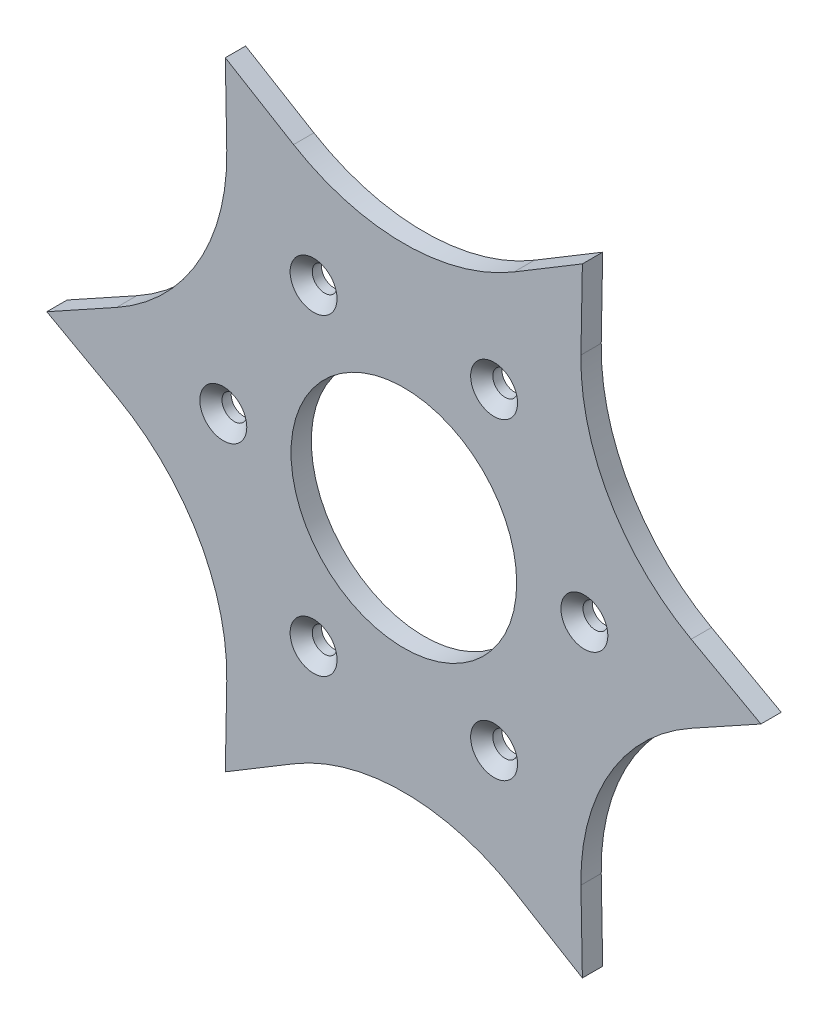
ISO-10303-21;
HEADER;
FILE_DESCRIPTION(('STEP AP214'),'2;1');
FILE_NAME('part.step','',(''),(''),'','','');
FILE_SCHEMA(('AUTOMOTIVE_DESIGN { 1 0 10303 214 1 1 1 1 }'));
ENDSEC;
DATA;
#1=APPLICATION_CONTEXT('core data for automotive mechanical design processes');
#2=APPLICATION_PROTOCOL_DEFINITION('international standard','automotive_design',2000,#1);
#3=PRODUCT_CONTEXT('',#1,'mechanical');
#4=PRODUCT('Part','Part','',(#3));
#5=PRODUCT_RELATED_PRODUCT_CATEGORY('part','',(#4));
#6=PRODUCT_DEFINITION_FORMATION('','',#4);
#7=PRODUCT_DEFINITION_CONTEXT('part definition',#1,'design');
#8=PRODUCT_DEFINITION('design','',#6,#7);
#9=PRODUCT_DEFINITION_SHAPE('','',#8);
#10=(LENGTH_UNIT() NAMED_UNIT(*) SI_UNIT(.MILLI.,.METRE.));
#11=(NAMED_UNIT(*) PLANE_ANGLE_UNIT() SI_UNIT($,.RADIAN.));
#12=(NAMED_UNIT(*) SI_UNIT($,.STERADIAN.) SOLID_ANGLE_UNIT());
#13=UNCERTAINTY_MEASURE_WITH_UNIT(LENGTH_MEASURE(1.E-05),#10,'distance_accuracy_value','');
#14=(GEOMETRIC_REPRESENTATION_CONTEXT(3) GLOBAL_UNCERTAINTY_ASSIGNED_CONTEXT((#13)) GLOBAL_UNIT_ASSIGNED_CONTEXT((#10,
#11,#12)) REPRESENTATION_CONTEXT('',''));
#15=CARTESIAN_POINT('',(0.,0.,0.));
#16=DIRECTION('',(0.,0.,1.));
#17=DIRECTION('',(1.,0.,0.));
#18=AXIS2_PLACEMENT_3D('',#15,#16,#17);
#19=CARTESIAN_POINT('',(86.6025403784862,-49.9999999999703,67.0456126137309));
#20=DIRECTION('',(0.,0.,-1.));
#21=DIRECTION('',(-1.,0.,0.));
#22=AXIS2_PLACEMENT_3D('',#19,#20,#21);
#23=CYLINDRICAL_SURFACE('',#22,47.375);
#24=CARTESIAN_POINT('',(86.6025403784862,-49.9999999999703,62.5456126137309));
#25=DIRECTION('',(0.,0.,1.));
#26=DIRECTION('',(1.,0.,0.));
#27=AXIS2_PLACEMENT_3D('',#24,#25,#26);
#28=CIRCLE('',#27,47.375);
#29=CARTESIAN_POINT('',(63.667217125157,-8.54687499997423,62.5456126137309));
#30=VERTEX_POINT('',#29);
#31=CARTESIAN_POINT('',(39.2354194355732,-50.8639899185789,62.5456126137309));
#32=VERTEX_POINT('',#31);
#33=EDGE_CURVE('E192',#30,#32,#28,.T.);
#34=ORIENTED_EDGE('',*,*,#33,.F.);
#35=DIRECTION('',(0.,0.,-1.));
#36=VECTOR('',#35,1.);
#37=CARTESIAN_POINT('',(63.667217125157,-8.54687499997423,67.0456126137309));
#38=LINE('',#37,#36);
#39=CARTESIAN_POINT('',(63.667217125157,-8.54687499997423,67.0456126137309));
#40=VERTEX_POINT('',#39);
#41=EDGE_CURVE('E11',#40,#30,#38,.T.);
#42=ORIENTED_EDGE('',*,*,#41,.F.);
#43=CARTESIAN_POINT('',(86.6025403784862,-49.9999999999703,67.0456126137309));
#44=DIRECTION('',(0.,0.,1.));
#45=DIRECTION('',(1.,0.,0.));
#46=AXIS2_PLACEMENT_3D('',#43,#44,#45);
#47=CIRCLE('',#46,47.375);
#48=CARTESIAN_POINT('',(39.2354194355732,-50.8639899185789,67.0456126137309));
#49=VERTEX_POINT('',#48);
#50=EDGE_CURVE('E246',#40,#49,#47,.T.);
#51=ORIENTED_EDGE('',*,*,#50,.T.);
#52=DIRECTION('',(0.,0.,-1.));
#53=VECTOR('',#52,1.);
#54=CARTESIAN_POINT('',(39.2354194355732,-50.8639899185789,67.0456126137309));
#55=LINE('',#54,#53);
#56=EDGE_CURVE('E115',#49,#32,#55,.T.);
#57=ORIENTED_EDGE('',*,*,#56,.T.);
#58=EDGE_LOOP('',(#34,#42,#51,#57));
#59=FACE_BOUND('',#58,.T.);
#60=ADVANCED_FACE('F35',(#59),#23,.F.);
#61=CARTESIAN_POINT('',(18.542524822455,-33.5136152558557,67.0456126137309));
#62=DIRECTION('',(0.484122918276079,-0.874999999999916,0.));
#63=DIRECTION('',(0.874999999999916,0.484122918276079,0.));
#64=AXIS2_PLACEMENT_3D('',#61,#62,#63);
#65=PLANE('',#64);
#66=DIRECTION('',(-0.874999999999916,-0.484122918276079,0.));
#67=VECTOR('',#66,1.);
#68=CARTESIAN_POINT('',(18.542524822455,-33.5136152558557,62.5456126137309));
#69=LINE('',#68,#67);
#70=CARTESIAN_POINT('',(79.1147725758089,2.79082312815149E-11,62.5456126137309));
#71=VERTEX_POINT('',#70);
#72=EDGE_CURVE('E195',#71,#30,#69,.T.);
#73=ORIENTED_EDGE('',*,*,#72,.F.);
#74=DIRECTION('',(0.,0.,-1.));
#75=VECTOR('',#74,1.);
#76=CARTESIAN_POINT('',(79.1147725758089,2.79082312815149E-11,67.0456126137309));
#77=LINE('',#76,#75);
#78=CARTESIAN_POINT('',(79.1147725758089,2.79082312815149E-11,67.0456126137309));
#79=VERTEX_POINT('',#78);
#80=EDGE_CURVE('E43',#79,#71,#77,.T.);
#81=ORIENTED_EDGE('',*,*,#80,.F.);
#82=DIRECTION('',(-0.874999999999916,-0.484122918276079,0.));
#83=VECTOR('',#82,1.);
#84=CARTESIAN_POINT('',(18.542524822455,-33.5136152558557,67.0456126137309));
#85=LINE('',#84,#83);
#86=EDGE_CURVE('E288',#79,#40,#85,.T.);
#87=ORIENTED_EDGE('',*,*,#86,.T.);
#88=ORIENTED_EDGE('',*,*,#41,.T.);
#89=EDGE_LOOP('',(#73,#81,#87,#88));
#90=FACE_BOUND('',#89,.T.);
#91=ADVANCED_FACE('F287',(#90),#65,.T.);
#92=CARTESIAN_POINT('',(18.5425248224775,33.5136152558977,67.0456126137309));
#93=DIRECTION('',(-0.484122918276064,-0.874999999999924,0.));
#94=DIRECTION('',(0.874999999999924,-0.484122918276064,0.));
#95=AXIS2_PLACEMENT_3D('',#92,#93,#94);
#96=PLANE('',#95);
#97=DIRECTION('',(-0.874999999999924,0.484122918276064,0.));
#98=VECTOR('',#97,1.);
#99=CARTESIAN_POINT('',(18.5425248224775,33.5136152558977,62.5456126137309));
#100=LINE('',#99,#98);
#101=CARTESIAN_POINT('',(63.6672171251116,8.54687500005483,62.5456126137309));
#102=VERTEX_POINT('',#101);
#103=EDGE_CURVE('E199',#71,#102,#100,.T.);
#104=ORIENTED_EDGE('',*,*,#103,.T.);
#105=DIRECTION('',(0.,0.,-1.));
#106=VECTOR('',#105,1.);
#107=CARTESIAN_POINT('',(63.6672171251116,8.54687500005483,67.0456126137309));
#108=LINE('',#107,#106);
#109=CARTESIAN_POINT('',(63.6672171251116,8.54687500005483,67.0456126137309));
#110=VERTEX_POINT('',#109);
#111=EDGE_CURVE('E272',#110,#102,#108,.T.);
#112=ORIENTED_EDGE('',*,*,#111,.F.);
#113=DIRECTION('',(-0.874999999999924,0.484122918276064,0.));
#114=VECTOR('',#113,1.);
#115=CARTESIAN_POINT('',(18.5425248224775,33.5136152558977,67.0456126137309));
#116=LINE('',#115,#114);
#117=EDGE_CURVE('E278',#79,#110,#116,.T.);
#118=ORIENTED_EDGE('',*,*,#117,.F.);
#119=ORIENTED_EDGE('',*,*,#80,.T.);
#120=EDGE_LOOP('',(#104,#112,#118,#119));
#121=FACE_BOUND('',#120,.T.);
#122=ADVANCED_FACE('F276',(#121),#96,.F.);
#123=CARTESIAN_POINT('',(86.6025403784392,50.0000000000517,67.0456126137309));
#124=DIRECTION('',(0.,0.,-1.));
#125=DIRECTION('',(-1.,0.,0.));
#126=AXIS2_PLACEMENT_3D('',#123,#124,#125);
#127=CYLINDRICAL_SURFACE('',#126,47.375);
#128=CARTESIAN_POINT('',(86.6025403784392,50.0000000000517,62.5456126137309));
#129=DIRECTION('',(0.,0.,1.));
#130=DIRECTION('',(1.,0.,0.));
#131=AXIS2_PLACEMENT_3D('',#128,#129,#130);
#132=CIRCLE('',#131,47.375);
#133=CARTESIAN_POINT('',(39.2354194355262,50.8639899186586,62.5456126137309));
#134=VERTEX_POINT('',#133);
#135=EDGE_CURVE('E202',#134,#102,#132,.T.);
#136=ORIENTED_EDGE('',*,*,#135,.F.);
#137=DIRECTION('',(0.,0.,-1.));
#138=VECTOR('',#137,1.);
#139=CARTESIAN_POINT('',(39.2354194355262,50.8639899186586,67.0456126137309));
#140=LINE('',#139,#138);
#141=CARTESIAN_POINT('',(39.2354194355262,50.8639899186586,67.0456126137309));
#142=VERTEX_POINT('',#141);
#143=EDGE_CURVE('E270',#142,#134,#140,.T.);
#144=ORIENTED_EDGE('',*,*,#143,.F.);
#145=CARTESIAN_POINT('',(86.6025403784392,50.0000000000517,67.0456126137309));
#146=DIRECTION('',(0.,0.,1.));
#147=DIRECTION('',(1.,0.,0.));
#148=AXIS2_PLACEMENT_3D('',#145,#146,#147);
#149=CIRCLE('',#148,47.375);
#150=EDGE_CURVE('E296',#142,#110,#149,.T.);
#151=ORIENTED_EDGE('',*,*,#150,.T.);
#152=ORIENTED_EDGE('',*,*,#111,.T.);
#153=EDGE_LOOP('',(#136,#144,#151,#152));
#154=FACE_BOUND('',#153,.T.);
#155=ADVANCED_FACE('F354',(#154),#127,.F.);
#156=CARTESIAN_POINT('',(38.2949045954563,-0.698510081378177,67.0456126137309));
#157=DIRECTION('',(0.999833687449351,-0.0182372542186135,0.));
#158=DIRECTION('',(0.0182372542186135,0.999833687449351,0.));
#159=AXIS2_PLACEMENT_3D('',#156,#157,#158);
#160=PLANE('',#159);
#161=DIRECTION('',(-0.0182372542186135,-0.999833687449351,0.));
#162=VECTOR('',#161,1.);
#163=CARTESIAN_POINT('',(38.2949045954563,-0.698510081378177,62.5456126137309));
#164=LINE('',#163,#162);
#165=CARTESIAN_POINT('',(39.5573862878801,68.515402865293,62.5456126137309));
#166=VERTEX_POINT('',#165);
#167=EDGE_CURVE('E205',#166,#134,#164,.T.);
#168=ORIENTED_EDGE('',*,*,#167,.F.);
#169=DIRECTION('',(0.,0.,-1.));
#170=VECTOR('',#169,1.);
#171=CARTESIAN_POINT('',(39.5573862878801,68.515402865293,67.0456126137309));
#172=LINE('',#171,#170);
#173=CARTESIAN_POINT('',(39.5573862878801,68.515402865293,67.0456126137309));
#174=VERTEX_POINT('',#173);
#175=EDGE_CURVE('E268',#174,#166,#172,.T.);
#176=ORIENTED_EDGE('',*,*,#175,.F.);
#177=DIRECTION('',(-0.0182372542186135,-0.999833687449351,0.));
#178=VECTOR('',#177,1.);
#179=CARTESIAN_POINT('',(38.2949045954563,-0.698510081378177,67.0456126137309));
#180=LINE('',#179,#178);
#181=EDGE_CURVE('E299',#174,#142,#180,.T.);
#182=ORIENTED_EDGE('',*,*,#181,.T.);
#183=ORIENTED_EDGE('',*,*,#143,.T.);
#184=EDGE_LOOP('',(#168,#176,#182,#183));
#185=FACE_BOUND('',#184,.T.);
#186=ADVANCED_FACE('F359',(#185),#160,.T.);
#187=CARTESIAN_POINT('',(-19.7523797730264,32.8151051745179,67.0456126137309));
#188=DIRECTION('',(0.515710769173288,-0.85676274578129,0.));
#189=DIRECTION('',(0.85676274578129,0.515710769173288,0.));
#190=AXIS2_PLACEMENT_3D('',#187,#188,#189);
#191=PLANE('',#190);
#192=DIRECTION('',(-0.85676274578129,-0.515710769173288,0.));
#193=VECTOR('',#192,1.);
#194=CARTESIAN_POINT('',(-19.7523797730264,32.8151051745179,62.5456126137309));
#195=LINE('',#194,#193);
#196=CARTESIAN_POINT('',(24.4317976895381,59.4108649186337,62.5456126137309));
#197=VERTEX_POINT('',#196);
#198=EDGE_CURVE('E208',#166,#197,#195,.T.);
#199=ORIENTED_EDGE('',*,*,#198,.T.);
#200=DIRECTION('',(0.,0.,-1.));
#201=VECTOR('',#200,1.);
#202=CARTESIAN_POINT('',(24.4317976895381,59.4108649186337,67.0456126137309));
#203=LINE('',#202,#201);
#204=CARTESIAN_POINT('',(24.4317976895381,59.4108649186337,67.0456126137309));
#205=VERTEX_POINT('',#204);
#206=EDGE_CURVE('E266',#205,#197,#203,.T.);
#207=ORIENTED_EDGE('',*,*,#206,.F.);
#208=DIRECTION('',(-0.85676274578129,-0.515710769173288,0.));
#209=VECTOR('',#208,1.);
#210=CARTESIAN_POINT('',(-19.7523797730264,32.8151051745179,67.0456126137309));
#211=LINE('',#210,#209);
#212=EDGE_CURVE('E302',#174,#205,#211,.T.);
#213=ORIENTED_EDGE('',*,*,#212,.F.);
#214=ORIENTED_EDGE('',*,*,#175,.T.);
#215=EDGE_LOOP('',(#199,#207,#213,#214));
#216=FACE_BOUND('',#215,.T.);
#217=ADVANCED_FACE('F363',(#216),#191,.F.);
#218=CARTESIAN_POINT('',(-4.73438357580261E-11,100.000000000022,67.0456126137309));
#219=DIRECTION('',(0.,0.,-1.));
#220=DIRECTION('',(-1.,0.,0.));
#221=AXIS2_PLACEMENT_3D('',#218,#219,#220);
#222=CYLINDRICAL_SURFACE('',#221,47.375);
#223=CARTESIAN_POINT('',(-4.73438357580261E-11,100.000000000022,62.5456126137309));
#224=DIRECTION('',(0.,0.,1.));
#225=DIRECTION('',(1.,0.,0.));
#226=AXIS2_PLACEMENT_3D('',#223,#224,#225);
#227=CIRCLE('',#226,47.375);
#228=CARTESIAN_POINT('',(-24.4317976896309,59.4108649186326,62.5456126137309));
#229=VERTEX_POINT('',#228);
#230=EDGE_CURVE('E211',#229,#197,#227,.T.);
#231=ORIENTED_EDGE('',*,*,#230,.F.);
#232=DIRECTION('',(0.,0.,-1.));
#233=VECTOR('',#232,1.);
#234=CARTESIAN_POINT('',(-24.4317976896309,59.4108649186326,67.0456126137309));
#235=LINE('',#234,#233);
#236=CARTESIAN_POINT('',(-24.4317976896309,59.4108649186326,67.0456126137309));
#237=VERTEX_POINT('',#236);
#238=EDGE_CURVE('E264',#237,#229,#235,.T.);
#239=ORIENTED_EDGE('',*,*,#238,.F.);
#240=CARTESIAN_POINT('',(-4.73438357580261E-11,100.000000000022,67.0456126137309));
#241=DIRECTION('',(0.,0.,1.));
#242=DIRECTION('',(1.,0.,0.));
#243=AXIS2_PLACEMENT_3D('',#240,#241,#242);
#244=CIRCLE('',#243,47.375);
#245=EDGE_CURVE('E304',#237,#205,#244,.T.);
#246=ORIENTED_EDGE('',*,*,#245,.T.);
#247=ORIENTED_EDGE('',*,*,#206,.T.);
#248=EDGE_LOOP('',(#231,#239,#246,#247));
#249=FACE_BOUND('',#248,.T.);
#250=ADVANCED_FACE('F367',(#249),#222,.F.);
#251=CARTESIAN_POINT('',(19.7523797730011,32.8151051744776,67.0456126137309));
#252=DIRECTION('',(0.515710769173268,0.856762745781303,0.));
#253=DIRECTION('',(-0.856762745781303,0.515710769173268,0.));
#254=AXIS2_PLACEMENT_3D('',#251,#252,#253);
#255=PLANE('',#254);
#256=DIRECTION('',(0.856762745781303,-0.515710769173268,0.));
#257=VECTOR('',#256,1.);
#258=CARTESIAN_POINT('',(19.7523797730011,32.8151051744776,62.5456126137309));
#259=LINE('',#258,#257);
#260=CARTESIAN_POINT('',(-39.5573862879289,68.5154028652648,62.5456126137309));
#261=VERTEX_POINT('',#260);
#262=EDGE_CURVE('E214',#261,#229,#259,.T.);
#263=ORIENTED_EDGE('',*,*,#262,.F.);
#264=DIRECTION('',(0.,0.,-1.));
#265=VECTOR('',#264,1.);
#266=CARTESIAN_POINT('',(-39.5573862879289,68.5154028652648,67.0456126137309));
#267=LINE('',#266,#265);
#268=CARTESIAN_POINT('',(-39.5573862879289,68.5154028652648,67.0456126137309));
#269=VERTEX_POINT('',#268);
#270=EDGE_CURVE('E262',#269,#261,#267,.T.);
#271=ORIENTED_EDGE('',*,*,#270,.F.);
#272=DIRECTION('',(0.856762745781303,-0.515710769173268,0.));
#273=VECTOR('',#272,1.);
#274=CARTESIAN_POINT('',(19.7523797730011,32.8151051744776,67.0456126137309));
#275=LINE('',#274,#273);
#276=EDGE_CURVE('E307',#269,#237,#275,.T.);
#277=ORIENTED_EDGE('',*,*,#276,.T.);
#278=ORIENTED_EDGE('',*,*,#238,.T.);
#279=EDGE_LOOP('',(#263,#271,#277,#278));
#280=FACE_BOUND('',#279,.T.);
#281=ADVANCED_FACE('F371',(#280),#255,.T.);
#282=CARTESIAN_POINT('',(-38.2949045955039,-0.69851008137995,67.0456126137309));
#283=DIRECTION('',(0.99983368744935,0.0182372542186371,0.));
#284=DIRECTION('',(-0.0182372542186371,0.99983368744935,0.));
#285=AXIS2_PLACEMENT_3D('',#282,#283,#284);
#286=PLANE('',#285);
#287=DIRECTION('',(0.0182372542186371,-0.99983368744935,0.));
#288=VECTOR('',#287,1.);
#289=CARTESIAN_POINT('',(-38.2949045955039,-0.69851008137995,62.5456126137309));
#290=LINE('',#289,#288);
#291=CARTESIAN_POINT('',(-39.2354194355736,50.8639899185787,62.5456126137309));
#292=VERTEX_POINT('',#291);
#293=EDGE_CURVE('E217',#261,#292,#290,.T.);
#294=ORIENTED_EDGE('',*,*,#293,.T.);
#295=DIRECTION('',(0.,0.,-1.));
#296=VECTOR('',#295,1.);
#297=CARTESIAN_POINT('',(-39.2354194355736,50.8639899185787,67.0456126137309));
#298=LINE('',#297,#296);
#299=CARTESIAN_POINT('',(-39.2354194355736,50.8639899185787,67.0456126137309));
#300=VERTEX_POINT('',#299);
#301=EDGE_CURVE('E260',#300,#292,#298,.T.);
#302=ORIENTED_EDGE('',*,*,#301,.F.);
#303=DIRECTION('',(0.0182372542186371,-0.99983368744935,0.));
#304=VECTOR('',#303,1.);
#305=CARTESIAN_POINT('',(-38.2949045955039,-0.69851008137995,67.0456126137309));
#306=LINE('',#305,#304);
#307=EDGE_CURVE('E310',#269,#300,#306,.T.);
#308=ORIENTED_EDGE('',*,*,#307,.F.);
#309=ORIENTED_EDGE('',*,*,#270,.T.);
#310=EDGE_LOOP('',(#294,#302,#308,#309));
#311=FACE_BOUND('',#310,.T.);
#312=ADVANCED_FACE('F375',(#311),#286,.F.);
#313=CARTESIAN_POINT('',(-86.6025403784866,49.9999999999697,67.0456126137309));
#314=DIRECTION('',(0.,0.,-1.));
#315=DIRECTION('',(-1.,0.,0.));
#316=AXIS2_PLACEMENT_3D('',#313,#314,#315);
#317=CYLINDRICAL_SURFACE('',#316,47.375);
#318=CARTESIAN_POINT('',(-86.6025403784866,49.9999999999697,62.5456126137309));
#319=DIRECTION('',(0.,0.,1.));
#320=DIRECTION('',(1.,0.,0.));
#321=AXIS2_PLACEMENT_3D('',#318,#319,#320);
#322=CIRCLE('',#321,47.375);
#323=CARTESIAN_POINT('',(-63.6672171251571,8.54687499997385,62.5456126137309));
#324=VERTEX_POINT('',#323);
#325=EDGE_CURVE('E220',#324,#292,#322,.T.);
#326=ORIENTED_EDGE('',*,*,#325,.F.);
#327=DIRECTION('',(0.,0.,-1.));
#328=VECTOR('',#327,1.);
#329=CARTESIAN_POINT('',(-63.6672171251571,8.54687499997385,67.0456126137309));
#330=LINE('',#329,#328);
#331=CARTESIAN_POINT('',(-63.6672171251571,8.54687499997385,67.0456126137309));
#332=VERTEX_POINT('',#331);
#333=EDGE_CURVE('E258',#332,#324,#330,.T.);
#334=ORIENTED_EDGE('',*,*,#333,.F.);
#335=CARTESIAN_POINT('',(-86.6025403784866,49.9999999999697,67.0456126137309));
#336=DIRECTION('',(0.,0.,1.));
#337=DIRECTION('',(1.,0.,0.));
#338=AXIS2_PLACEMENT_3D('',#335,#336,#337);
#339=CIRCLE('',#338,47.375);
#340=EDGE_CURVE('E312',#332,#300,#339,.T.);
#341=ORIENTED_EDGE('',*,*,#340,.T.);
#342=ORIENTED_EDGE('',*,*,#301,.T.);
#343=EDGE_LOOP('',(#326,#334,#341,#342));
#344=FACE_BOUND('',#343,.T.);
#345=ADVANCED_FACE('F379',(#344),#317,.F.);
#346=CARTESIAN_POINT('',(-18.5425248224553,33.5136152558556,67.0456126137309));
#347=DIRECTION('',(-0.484122918276086,0.874999999999912,0.));
#348=DIRECTION('',(-0.874999999999913,-0.484122918276086,0.));
#349=AXIS2_PLACEMENT_3D('',#346,#347,#348);
#350=PLANE('',#349);
#351=DIRECTION('',(0.874999999999912,0.484122918276086,0.));
#352=VECTOR('',#351,1.);
#353=CARTESIAN_POINT('',(-18.5425248224553,33.5136152558556,62.5456126137309));
#354=LINE('',#353,#352);
#355=CARTESIAN_POINT('',(-79.1147725758089,-2.83870149608845E-11,62.5456126137309));
#356=VERTEX_POINT('',#355);
#357=EDGE_CURVE('E223',#356,#324,#354,.T.);
#358=ORIENTED_EDGE('',*,*,#357,.F.);
#359=DIRECTION('',(0.,0.,-1.));
#360=VECTOR('',#359,1.);
#361=CARTESIAN_POINT('',(-79.1147725758089,-2.83870149608845E-11,67.0456126137309));
#362=LINE('',#361,#360);
#363=CARTESIAN_POINT('',(-79.1147725758089,-2.83870149608845E-11,67.0456126137309));
#364=VERTEX_POINT('',#363);
#365=EDGE_CURVE('E256',#364,#356,#362,.T.);
#366=ORIENTED_EDGE('',*,*,#365,.F.);
#367=DIRECTION('',(0.874999999999912,0.484122918276086,0.));
#368=VECTOR('',#367,1.);
#369=CARTESIAN_POINT('',(-18.5425248224553,33.5136152558556,67.0456126137309));
#370=LINE('',#369,#368);
#371=EDGE_CURVE('E315',#364,#332,#370,.T.);
#372=ORIENTED_EDGE('',*,*,#371,.T.);
#373=ORIENTED_EDGE('',*,*,#333,.T.);
#374=EDGE_LOOP('',(#358,#366,#372,#373));
#375=FACE_BOUND('',#374,.T.);
#376=ADVANCED_FACE('F383',(#375),#350,.T.);
#377=CARTESIAN_POINT('',(-18.5425248224773,-33.5136152558978,67.0456126137309));
#378=DIRECTION('',(0.484122918276058,0.874999999999927,0.));
#379=DIRECTION('',(-0.874999999999928,0.484122918276058,0.));
#380=AXIS2_PLACEMENT_3D('',#377,#378,#379);
#381=PLANE('',#380);
#382=DIRECTION('',(0.874999999999927,-0.484122918276058,0.));
#383=VECTOR('',#382,1.);
#384=CARTESIAN_POINT('',(-18.5425248224773,-33.5136152558978,62.5456126137309));
#385=LINE('',#384,#383);
#386=CARTESIAN_POINT('',(-63.6672171251115,-8.54687500005522,62.5456126137309));
#387=VERTEX_POINT('',#386);
#388=EDGE_CURVE('E226',#356,#387,#385,.T.);
#389=ORIENTED_EDGE('',*,*,#388,.T.);
#390=DIRECTION('',(0.,0.,-1.));
#391=VECTOR('',#390,1.);
#392=CARTESIAN_POINT('',(-63.6672171251115,-8.54687500005522,67.0456126137309));
#393=LINE('',#392,#391);
#394=CARTESIAN_POINT('',(-63.6672171251115,-8.54687500005522,67.0456126137309));
#395=VERTEX_POINT('',#394);
#396=EDGE_CURVE('E254',#395,#387,#393,.T.);
#397=ORIENTED_EDGE('',*,*,#396,.F.);
#398=DIRECTION('',(0.874999999999927,-0.484122918276058,0.));
#399=VECTOR('',#398,1.);
#400=CARTESIAN_POINT('',(-18.5425248224773,-33.5136152558978,67.0456126137309));
#401=LINE('',#400,#399);
#402=EDGE_CURVE('E318',#364,#395,#401,.T.);
#403=ORIENTED_EDGE('',*,*,#402,.F.);
#404=ORIENTED_EDGE('',*,*,#365,.T.);
#405=EDGE_LOOP('',(#389,#397,#403,#404));
#406=FACE_BOUND('',#405,.T.);
#407=ADVANCED_FACE('F387',(#406),#381,.F.);
#408=CARTESIAN_POINT('',(-86.6025403784388,-50.0000000000523,67.0456126137309));
#409=DIRECTION('',(0.,0.,-1.));
#410=DIRECTION('',(-1.,0.,0.));
#411=AXIS2_PLACEMENT_3D('',#408,#409,#410);
#412=CYLINDRICAL_SURFACE('',#411,47.375);
#413=CARTESIAN_POINT('',(-86.6025403784388,-50.0000000000523,62.5456126137309));
#414=DIRECTION('',(0.,0.,1.));
#415=DIRECTION('',(1.,0.,0.));
#416=AXIS2_PLACEMENT_3D('',#413,#414,#415);
#417=CIRCLE('',#416,47.375);
#418=CARTESIAN_POINT('',(-39.2354194355258,-50.8639899186588,62.5456126137309));
#419=VERTEX_POINT('',#418);
#420=EDGE_CURVE('E229',#419,#387,#417,.T.);
#421=ORIENTED_EDGE('',*,*,#420,.F.);
#422=DIRECTION('',(0.,0.,-1.));
#423=VECTOR('',#422,1.);
#424=CARTESIAN_POINT('',(-39.2354194355258,-50.8639899186588,67.0456126137309));
#425=LINE('',#424,#423);
#426=CARTESIAN_POINT('',(-39.2354194355258,-50.8639899186588,67.0456126137309));
#427=VERTEX_POINT('',#426);
#428=EDGE_CURVE('E252',#427,#419,#425,.T.);
#429=ORIENTED_EDGE('',*,*,#428,.F.);
#430=CARTESIAN_POINT('',(-86.6025403784388,-50.0000000000523,67.0456126137309));
#431=DIRECTION('',(0.,0.,1.));
#432=DIRECTION('',(1.,0.,0.));
#433=AXIS2_PLACEMENT_3D('',#430,#431,#432);
#434=CIRCLE('',#433,47.375);
#435=EDGE_CURVE('E320',#427,#395,#434,.T.);
#436=ORIENTED_EDGE('',*,*,#435,.T.);
#437=ORIENTED_EDGE('',*,*,#396,.T.);
#438=EDGE_LOOP('',(#421,#429,#436,#437));
#439=FACE_BOUND('',#438,.T.);
#440=ADVANCED_FACE('F334',(#439),#412,.F.);
#441=CARTESIAN_POINT('',(-38.2949045954563,0.698510081377892,67.0456126137309));
#442=DIRECTION('',(-0.999833687449351,0.0182372542186061,0.));
#443=DIRECTION('',(-0.0182372542186061,-0.999833687449351,0.));
#444=AXIS2_PLACEMENT_3D('',#441,#442,#443);
#445=PLANE('',#444);
#446=DIRECTION('',(0.0182372542186061,0.999833687449351,0.));
#447=VECTOR('',#446,1.);
#448=CARTESIAN_POINT('',(-38.2949045954563,0.698510081377892,62.5456126137309));
#449=LINE('',#448,#447);
#450=CARTESIAN_POINT('',(-39.5573862878796,-68.5154028652932,62.5456126137309));
#451=VERTEX_POINT('',#450);
#452=EDGE_CURVE('E232',#451,#419,#449,.T.);
#453=ORIENTED_EDGE('',*,*,#452,.F.);
#454=DIRECTION('',(0.,0.,-1.));
#455=VECTOR('',#454,1.);
#456=CARTESIAN_POINT('',(-39.5573862878796,-68.5154028652932,67.0456126137309));
#457=LINE('',#456,#455);
#458=CARTESIAN_POINT('',(-39.5573862878796,-68.5154028652932,67.0456126137309));
#459=VERTEX_POINT('',#458);
#460=EDGE_CURVE('E250',#459,#451,#457,.T.);
#461=ORIENTED_EDGE('',*,*,#460,.F.);
#462=DIRECTION('',(0.0182372542186061,0.999833687449351,0.));
#463=VECTOR('',#462,1.);
#464=CARTESIAN_POINT('',(-38.2949045954563,0.698510081377892,67.0456126137309));
#465=LINE('',#464,#463);
#466=EDGE_CURVE('E323',#459,#427,#465,.T.);
#467=ORIENTED_EDGE('',*,*,#466,.T.);
#468=ORIENTED_EDGE('',*,*,#428,.T.);
#469=EDGE_LOOP('',(#453,#461,#467,#468));
#470=FACE_BOUND('',#469,.T.);
#471=ADVANCED_FACE('F327',(#470),#445,.T.);
#472=CARTESIAN_POINT('',(19.7523797730267,-32.8151051745177,67.0456126137309));
#473=DIRECTION('',(-0.515710769173294,0.856762745781287,0.));
#474=DIRECTION('',(-0.856762745781287,-0.515710769173294,0.));
#475=AXIS2_PLACEMENT_3D('',#472,#473,#474);
#476=PLANE('',#475);
#477=DIRECTION('',(0.856762745781287,0.515710769173294,0.));
#478=VECTOR('',#477,1.);
#479=CARTESIAN_POINT('',(19.7523797730267,-32.8151051745177,62.5456126137309));
#480=LINE('',#479,#478);
#481=CARTESIAN_POINT('',(-24.4317976895376,-59.4108649186339,62.5456126137309));
#482=VERTEX_POINT('',#481);
#483=EDGE_CURVE('E235',#451,#482,#480,.T.);
#484=ORIENTED_EDGE('',*,*,#483,.T.);
#485=DIRECTION('',(0.,0.,-1.));
#486=VECTOR('',#485,1.);
#487=CARTESIAN_POINT('',(-24.4317976895376,-59.4108649186339,67.0456126137309));
#488=LINE('',#487,#486);
#489=CARTESIAN_POINT('',(-24.4317976895376,-59.4108649186339,67.0456126137309));
#490=VERTEX_POINT('',#489);
#491=EDGE_CURVE('E174',#490,#482,#488,.T.);
#492=ORIENTED_EDGE('',*,*,#491,.F.);
#493=DIRECTION('',(0.856762745781287,0.515710769173294,0.));
#494=VECTOR('',#493,1.);
#495=CARTESIAN_POINT('',(19.7523797730267,-32.8151051745177,67.0456126137309));
#496=LINE('',#495,#494);
#497=EDGE_CURVE('E181',#459,#490,#496,.T.);
#498=ORIENTED_EDGE('',*,*,#497,.F.);
#499=ORIENTED_EDGE('',*,*,#460,.T.);
#500=EDGE_LOOP('',(#484,#492,#498,#499));
#501=FACE_BOUND('',#500,.T.);
#502=ADVANCED_FACE('F338',(#501),#476,.F.);
#503=CARTESIAN_POINT('',(4.80476707555124E-11,-100.000000000022,67.0456126137309));
#504=DIRECTION('',(0.,0.,-1.));
#505=DIRECTION('',(-1.,0.,0.));
#506=AXIS2_PLACEMENT_3D('',#503,#504,#505);
#507=CYLINDRICAL_SURFACE('',#506,47.375);
#508=CARTESIAN_POINT('',(4.80476707555124E-11,-100.000000000022,62.5456126137309));
#509=DIRECTION('',(0.,0.,1.));
#510=DIRECTION('',(1.,0.,0.));
#511=AXIS2_PLACEMENT_3D('',#508,#509,#510);
#512=CIRCLE('',#511,47.375);
#513=CARTESIAN_POINT('',(24.4317976896313,-59.4108649186324,62.5456126137309));
#514=VERTEX_POINT('',#513);
#515=EDGE_CURVE('E169',#514,#482,#512,.T.);
#516=ORIENTED_EDGE('',*,*,#515,.F.);
#517=DIRECTION('',(0.,0.,-1.));
#518=VECTOR('',#517,1.);
#519=CARTESIAN_POINT('',(24.4317976896313,-59.4108649186324,67.0456126137309));
#520=LINE('',#519,#518);
#521=CARTESIAN_POINT('',(24.4317976896313,-59.4108649186324,67.0456126137309));
#522=VERTEX_POINT('',#521);
#523=EDGE_CURVE('E164',#522,#514,#520,.T.);
#524=ORIENTED_EDGE('',*,*,#523,.F.);
#525=CARTESIAN_POINT('',(4.80476707555124E-11,-100.000000000022,67.0456126137309));
#526=DIRECTION('',(0.,0.,1.));
#527=DIRECTION('',(1.,0.,0.));
#528=AXIS2_PLACEMENT_3D('',#525,#526,#527);
#529=CIRCLE('',#528,47.375);
#530=EDGE_CURVE('E167',#522,#490,#529,.T.);
#531=ORIENTED_EDGE('',*,*,#530,.T.);
#532=ORIENTED_EDGE('',*,*,#491,.T.);
#533=EDGE_LOOP('',(#516,#524,#531,#532));
#534=FACE_BOUND('',#533,.T.);
#535=ADVANCED_FACE('F166',(#534),#507,.F.);
#536=CARTESIAN_POINT('',(-19.7523797730009,-32.8151051744777,67.0456126137309));
#537=DIRECTION('',(-0.515710769173261,-0.856762745781306,0.));
#538=DIRECTION('',(0.856762745781307,-0.515710769173261,0.));
#539=AXIS2_PLACEMENT_3D('',#536,#537,#538);
#540=PLANE('',#539);
#541=DIRECTION('',(-0.856762745781307,0.515710769173261,0.));
#542=VECTOR('',#541,1.);
#543=CARTESIAN_POINT('',(-19.7523797730009,-32.8151051744777,62.5456126137309));
#544=LINE('',#543,#542);
#545=CARTESIAN_POINT('',(39.5573862879284,-68.5154028652639,62.5456126137309));
#546=VERTEX_POINT('',#545);
#547=EDGE_CURVE('E239',#546,#514,#544,.T.);
#548=ORIENTED_EDGE('',*,*,#547,.F.);
#549=DIRECTION('',(0.,0.,-1.));
#550=VECTOR('',#549,1.);
#551=CARTESIAN_POINT('',(39.5573862879284,-68.5154028652639,67.0456126137309));
#552=LINE('',#551,#550);
#553=CARTESIAN_POINT('',(39.5573862879284,-68.5154028652639,67.0456126137309));
#554=VERTEX_POINT('',#553);
#555=EDGE_CURVE('E108',#554,#546,#552,.T.);
#556=ORIENTED_EDGE('',*,*,#555,.F.);
#557=DIRECTION('',(-0.856762745781307,0.515710769173261,0.));
#558=VECTOR('',#557,1.);
#559=CARTESIAN_POINT('',(-19.7523797730009,-32.8151051744777,67.0456126137309));
#560=LINE('',#559,#558);
#561=EDGE_CURVE('E178',#554,#522,#560,.T.);
#562=ORIENTED_EDGE('',*,*,#561,.T.);
#563=ORIENTED_EDGE('',*,*,#523,.T.);
#564=EDGE_LOOP('',(#548,#556,#562,#563));
#565=FACE_BOUND('',#564,.T.);
#566=ADVANCED_FACE('F184',(#565),#540,.T.);
#567=CARTESIAN_POINT('',(38.2949045955039,0.698510081379678,67.0456126137309));
#568=DIRECTION('',(-0.99983368744935,-0.0182372542186301,0.));
#569=DIRECTION('',(0.0182372542186301,-0.99983368744935,0.));
#570=AXIS2_PLACEMENT_3D('',#567,#568,#569);
#571=PLANE('',#570);
#572=DIRECTION('',(-0.0182372542186301,0.99983368744935,0.));
#573=VECTOR('',#572,1.);
#574=CARTESIAN_POINT('',(38.2949045955039,0.698510081379678,62.5456126137309));
#575=LINE('',#574,#573);
#576=EDGE_CURVE('E241',#546,#32,#575,.T.);
#577=ORIENTED_EDGE('',*,*,#576,.T.);
#578=ORIENTED_EDGE('',*,*,#56,.F.);
#579=DIRECTION('',(-0.0182372542186301,0.99983368744935,0.));
#580=VECTOR('',#579,1.);
#581=CARTESIAN_POINT('',(38.2949045955039,0.698510081379678,67.0456126137309));
#582=LINE('',#581,#580);
#583=EDGE_CURVE('E51',#554,#49,#582,.T.);
#584=ORIENTED_EDGE('',*,*,#583,.F.);
#585=ORIENTED_EDGE('',*,*,#555,.T.);
#586=EDGE_LOOP('',(#577,#578,#584,#585));
#587=FACE_BOUND('',#586,.T.);
#588=ADVANCED_FACE('F289',(#587),#571,.F.);
#589=CARTESIAN_POINT('',(0.,0.,67.0456126137309));
#590=DIRECTION('',(0.,0.,-1.));
#591=DIRECTION('',(-1.,0.,0.));
#592=AXIS2_PLACEMENT_3D('',#589,#590,#591);
#593=CYLINDRICAL_SURFACE('',#592,25.);
#594=CARTESIAN_POINT('',(0.,0.,67.0456126137309));
#595=DIRECTION('',(0.,0.,1.));
#596=DIRECTION('',(1.,0.,0.));
#597=AXIS2_PLACEMENT_3D('',#594,#595,#596);
#598=CIRCLE('',#597,25.);
#599=CARTESIAN_POINT('',(25.,0.,67.0456126137309));
#600=VERTEX_POINT('',#599);
#601=EDGE_CURVE('E186',#600,#600,#598,.T.);
#602=ORIENTED_EDGE('',*,*,#601,.T.);
#603=EDGE_LOOP('',(#602));
#604=FACE_BOUND('',#603,.T.);
#605=CARTESIAN_POINT('',(0.,0.,62.5456126137309));
#606=DIRECTION('',(0.,0.,1.));
#607=DIRECTION('',(1.,0.,0.));
#608=AXIS2_PLACEMENT_3D('',#605,#606,#607);
#609=CIRCLE('',#608,25.);
#610=CARTESIAN_POINT('',(25.,0.,62.5456126137309));
#611=VERTEX_POINT('',#610);
#612=EDGE_CURVE('E243',#611,#611,#609,.T.);
#613=ORIENTED_EDGE('',*,*,#612,.F.);
#614=EDGE_LOOP('',(#613));
#615=FACE_BOUND('',#614,.T.);
#616=ADVANCED_FACE('F428',(#604,#615),#593,.F.);
#617=CARTESIAN_POINT('',(0.,0.,67.0456126137309));
#618=DIRECTION('',(0.,0.,1.));
#619=DIRECTION('',(1.,0.,0.));
#620=AXIS2_PLACEMENT_3D('',#617,#618,#619);
#621=PLANE('',#620);
#622=CARTESIAN_POINT('',(-20.0000000000004,34.6410161513773,67.0456126137309));
#623=DIRECTION('',(0.,0.,1.));
#624=DIRECTION('',(1.,0.,0.));
#625=AXIS2_PLACEMENT_3D('',#622,#623,#624);
#626=CIRCLE('',#625,5.2);
#627=CARTESIAN_POINT('',(-14.8000000000004,34.6410161513773,67.0456126137309));
#628=VERTEX_POINT('',#627);
#629=EDGE_CURVE('E585',#628,#628,#626,.T.);
#630=ORIENTED_EDGE('',*,*,#629,.F.);
#631=EDGE_LOOP('',(#630));
#632=FACE_BOUND('',#631,.T.);
#633=CARTESIAN_POINT('',(19.9999999999997,34.6410161513777,67.0456126137309));
#634=DIRECTION('',(0.,0.,1.));
#635=DIRECTION('',(1.,0.,0.));
#636=AXIS2_PLACEMENT_3D('',#633,#634,#635);
#637=CIRCLE('',#636,5.2);
#638=CARTESIAN_POINT('',(25.1999999999997,34.6410161513777,67.0456126137309));
#639=VERTEX_POINT('',#638);
#640=EDGE_CURVE('E592',#639,#639,#637,.T.);
#641=ORIENTED_EDGE('',*,*,#640,.F.);
#642=EDGE_LOOP('',(#641));
#643=FACE_BOUND('',#642,.T.);
#644=CARTESIAN_POINT('',(40.,0.,67.0456126137309));
#645=DIRECTION('',(0.,0.,1.));
#646=DIRECTION('',(1.,0.,0.));
#647=AXIS2_PLACEMENT_3D('',#644,#645,#646);
#648=CIRCLE('',#647,5.2);
#649=CARTESIAN_POINT('',(45.2,0.,67.0456126137309));
#650=VERTEX_POINT('',#649);
#651=EDGE_CURVE('E601',#650,#650,#648,.T.);
#652=ORIENTED_EDGE('',*,*,#651,.F.);
#653=EDGE_LOOP('',(#652));
#654=FACE_BOUND('',#653,.T.);
#655=CARTESIAN_POINT('',(20.0000000000002,-34.6410161513775,67.0456126137309));
#656=DIRECTION('',(0.,0.,1.));
#657=DIRECTION('',(1.,0.,0.));
#658=AXIS2_PLACEMENT_3D('',#655,#656,#657);
#659=CIRCLE('',#658,5.2);
#660=CARTESIAN_POINT('',(25.2000000000002,-34.6410161513775,67.0456126137309));
#661=VERTEX_POINT('',#660);
#662=EDGE_CURVE('E610',#661,#661,#659,.T.);
#663=ORIENTED_EDGE('',*,*,#662,.F.);
#664=EDGE_LOOP('',(#663));
#665=FACE_BOUND('',#664,.T.);
#666=CARTESIAN_POINT('',(-19.9999999999999,-34.6410161513776,67.0456126137309));
#667=DIRECTION('',(0.,0.,1.));
#668=DIRECTION('',(1.,0.,0.));
#669=AXIS2_PLACEMENT_3D('',#666,#667,#668);
#670=CIRCLE('',#669,5.2);
#671=CARTESIAN_POINT('',(-14.7999999999999,-34.6410161513776,67.0456126137309));
#672=VERTEX_POINT('',#671);
#673=EDGE_CURVE('E619',#672,#672,#670,.T.);
#674=ORIENTED_EDGE('',*,*,#673,.F.);
#675=EDGE_LOOP('',(#674));
#676=FACE_BOUND('',#675,.T.);
#677=CARTESIAN_POINT('',(-40.,0.,67.0456126137309));
#678=DIRECTION('',(0.,0.,1.));
#679=DIRECTION('',(1.,0.,0.));
#680=AXIS2_PLACEMENT_3D('',#677,#678,#679);
#681=CIRCLE('',#680,5.2);
#682=CARTESIAN_POINT('',(-34.8,0.,67.0456126137309));
#683=VERTEX_POINT('',#682);
#684=EDGE_CURVE('E628',#683,#683,#681,.T.);
#685=ORIENTED_EDGE('',*,*,#684,.F.);
#686=EDGE_LOOP('',(#685));
#687=FACE_BOUND('',#686,.T.);
#688=ORIENTED_EDGE('',*,*,#50,.F.);
#689=ORIENTED_EDGE('',*,*,#86,.F.);
#690=ORIENTED_EDGE('',*,*,#117,.T.);
#691=ORIENTED_EDGE('',*,*,#150,.F.);
#692=ORIENTED_EDGE('',*,*,#181,.F.);
#693=ORIENTED_EDGE('',*,*,#212,.T.);
#694=ORIENTED_EDGE('',*,*,#245,.F.);
#695=ORIENTED_EDGE('',*,*,#276,.F.);
#696=ORIENTED_EDGE('',*,*,#307,.T.);
#697=ORIENTED_EDGE('',*,*,#340,.F.);
#698=ORIENTED_EDGE('',*,*,#371,.F.);
#699=ORIENTED_EDGE('',*,*,#402,.T.);
#700=ORIENTED_EDGE('',*,*,#435,.F.);
#701=ORIENTED_EDGE('',*,*,#466,.F.);
#702=ORIENTED_EDGE('',*,*,#497,.T.);
#703=ORIENTED_EDGE('',*,*,#530,.F.);
#704=ORIENTED_EDGE('',*,*,#561,.F.);
#705=ORIENTED_EDGE('',*,*,#583,.T.);
#706=EDGE_LOOP('',(#688,#689,#690,#691,#692,#693,#694,#695,#696,#697,#698,#699,#700,#701,#702,
#703,#704,#705));
#707=FACE_BOUND('',#706,.T.);
#708=ORIENTED_EDGE('',*,*,#601,.F.);
#709=EDGE_LOOP('',(#708));
#710=FACE_BOUND('',#709,.T.);
#711=ADVANCED_FACE('F176',(#632,#643,#654,#665,#676,#687,#707,#710),#621,.T.);
#712=CARTESIAN_POINT('',(0.,0.,62.5456126137309));
#713=DIRECTION('',(0.,0.,1.));
#714=DIRECTION('',(1.,0.,0.));
#715=AXIS2_PLACEMENT_3D('',#712,#713,#714);
#716=PLANE('',#715);
#717=CARTESIAN_POINT('',(-20.0000000000004,34.6410161513773,62.5456126137309));
#718=DIRECTION('',(0.,0.,1.));
#719=DIRECTION('',(1.,0.,0.));
#720=AXIS2_PLACEMENT_3D('',#717,#718,#719);
#721=CIRCLE('',#720,2.75);
#722=CARTESIAN_POINT('',(-17.2500000000004,34.6410161513773,62.5456126137309));
#723=VERTEX_POINT('',#722);
#724=EDGE_CURVE('E587',#723,#723,#721,.T.);
#725=ORIENTED_EDGE('',*,*,#724,.T.);
#726=EDGE_LOOP('',(#725));
#727=FACE_BOUND('',#726,.T.);
#728=CARTESIAN_POINT('',(19.9999999999997,34.6410161513777,62.5456126137309));
#729=DIRECTION('',(0.,0.,1.));
#730=DIRECTION('',(1.,0.,0.));
#731=AXIS2_PLACEMENT_3D('',#728,#729,#730);
#732=CIRCLE('',#731,2.75);
#733=CARTESIAN_POINT('',(22.7499999999997,34.6410161513777,62.5456126137309));
#734=VERTEX_POINT('',#733);
#735=EDGE_CURVE('E598',#734,#734,#732,.T.);
#736=ORIENTED_EDGE('',*,*,#735,.T.);
#737=EDGE_LOOP('',(#736));
#738=FACE_BOUND('',#737,.T.);
#739=CARTESIAN_POINT('',(40.,0.,62.5456126137309));
#740=DIRECTION('',(0.,0.,1.));
#741=DIRECTION('',(1.,0.,0.));
#742=AXIS2_PLACEMENT_3D('',#739,#740,#741);
#743=CIRCLE('',#742,2.75);
#744=CARTESIAN_POINT('',(42.75,0.,62.5456126137309));
#745=VERTEX_POINT('',#744);
#746=EDGE_CURVE('E607',#745,#745,#743,.T.);
#747=ORIENTED_EDGE('',*,*,#746,.T.);
#748=EDGE_LOOP('',(#747));
#749=FACE_BOUND('',#748,.T.);
#750=CARTESIAN_POINT('',(20.0000000000002,-34.6410161513775,62.5456126137309));
#751=DIRECTION('',(0.,0.,1.));
#752=DIRECTION('',(1.,0.,0.));
#753=AXIS2_PLACEMENT_3D('',#750,#751,#752);
#754=CIRCLE('',#753,2.75);
#755=CARTESIAN_POINT('',(22.7500000000002,-34.6410161513775,62.5456126137309));
#756=VERTEX_POINT('',#755);
#757=EDGE_CURVE('E616',#756,#756,#754,.T.);
#758=ORIENTED_EDGE('',*,*,#757,.T.);
#759=EDGE_LOOP('',(#758));
#760=FACE_BOUND('',#759,.T.);
#761=CARTESIAN_POINT('',(-19.9999999999999,-34.6410161513776,62.5456126137309));
#762=DIRECTION('',(0.,0.,1.));
#763=DIRECTION('',(1.,0.,0.));
#764=AXIS2_PLACEMENT_3D('',#761,#762,#763);
#765=CIRCLE('',#764,2.75);
#766=CARTESIAN_POINT('',(-17.2499999999999,-34.6410161513776,62.5456126137309));
#767=VERTEX_POINT('',#766);
#768=EDGE_CURVE('E625',#767,#767,#765,.T.);
#769=ORIENTED_EDGE('',*,*,#768,.T.);
#770=EDGE_LOOP('',(#769));
#771=FACE_BOUND('',#770,.T.);
#772=CARTESIAN_POINT('',(-40.,0.,62.5456126137309));
#773=DIRECTION('',(0.,0.,1.));
#774=DIRECTION('',(1.,0.,0.));
#775=AXIS2_PLACEMENT_3D('',#772,#773,#774);
#776=CIRCLE('',#775,2.75);
#777=CARTESIAN_POINT('',(-37.25,0.,62.5456126137309));
#778=VERTEX_POINT('',#777);
#779=EDGE_CURVE('E196',#778,#778,#776,.T.);
#780=ORIENTED_EDGE('',*,*,#779,.T.);
#781=EDGE_LOOP('',(#780));
#782=FACE_BOUND('',#781,.T.);
#783=ORIENTED_EDGE('',*,*,#33,.T.);
#784=ORIENTED_EDGE('',*,*,#576,.F.);
#785=ORIENTED_EDGE('',*,*,#547,.T.);
#786=ORIENTED_EDGE('',*,*,#515,.T.);
#787=ORIENTED_EDGE('',*,*,#483,.F.);
#788=ORIENTED_EDGE('',*,*,#452,.T.);
#789=ORIENTED_EDGE('',*,*,#420,.T.);
#790=ORIENTED_EDGE('',*,*,#388,.F.);
#791=ORIENTED_EDGE('',*,*,#357,.T.);
#792=ORIENTED_EDGE('',*,*,#325,.T.);
#793=ORIENTED_EDGE('',*,*,#293,.F.);
#794=ORIENTED_EDGE('',*,*,#262,.T.);
#795=ORIENTED_EDGE('',*,*,#230,.T.);
#796=ORIENTED_EDGE('',*,*,#198,.F.);
#797=ORIENTED_EDGE('',*,*,#167,.T.);
#798=ORIENTED_EDGE('',*,*,#135,.T.);
#799=ORIENTED_EDGE('',*,*,#103,.F.);
#800=ORIENTED_EDGE('',*,*,#72,.T.);
#801=EDGE_LOOP('',(#783,#784,#785,#786,#787,#788,#789,#790,#791,#792,#793,#794,#795,#796,#797,
#798,#799,#800));
#802=FACE_BOUND('',#801,.T.);
#803=ORIENTED_EDGE('',*,*,#612,.T.);
#804=EDGE_LOOP('',(#803));
#805=FACE_BOUND('',#804,.T.);
#806=ADVANCED_FACE('F284',(#727,#738,#749,#760,#771,#782,#802,#805),#716,.F.);
#807=CARTESIAN_POINT('',(-40.,0.,67.0456126137309));
#808=DIRECTION('',(0.,0.,1.));
#809=DIRECTION('',(1.,0.,0.));
#810=AXIS2_PLACEMENT_3D('',#807,#808,#809);
#811=CYLINDRICAL_SURFACE('',#810,2.74999999999999);
#812=ORIENTED_EDGE('',*,*,#779,.F.);
#813=EDGE_LOOP('',(#812));
#814=FACE_BOUND('',#813,.T.);
#815=CARTESIAN_POINT('',(-40.,0.,64.5956126137309));
#816=DIRECTION('',(0.,0.,1.));
#817=DIRECTION('',(1.,0.,0.));
#818=AXIS2_PLACEMENT_3D('',#815,#816,#817);
#819=CIRCLE('',#818,2.74999999999999);
#820=CARTESIAN_POINT('',(-37.25,0.,64.5956126137309));
#821=VERTEX_POINT('',#820);
#822=EDGE_CURVE('E630',#821,#821,#819,.T.);
#823=ORIENTED_EDGE('',*,*,#822,.T.);
#824=EDGE_LOOP('',(#823));
#825=FACE_BOUND('',#824,.T.);
#826=ADVANCED_FACE('F444',(#814,#825),#811,.F.);
#827=CARTESIAN_POINT('',(-40.,0.,67.0456126137309));
#828=DIRECTION('',(0.,0.,1.));
#829=DIRECTION('',(1.,0.,0.));
#830=AXIS2_PLACEMENT_3D('',#827,#828,#829);
#831=CONICAL_SURFACE('',#830,5.2,0.78539816339745);
#832=ORIENTED_EDGE('',*,*,#822,.F.);
#833=EDGE_LOOP('',(#832));
#834=FACE_BOUND('',#833,.T.);
#835=ORIENTED_EDGE('',*,*,#684,.T.);
#836=EDGE_LOOP('',(#835));
#837=FACE_BOUND('',#836,.T.);
#838=ADVANCED_FACE('F449',(#834,#837),#831,.F.);
#839=CARTESIAN_POINT('',(-19.9999999999999,-34.6410161513776,67.0456126137309));
#840=DIRECTION('',(0.,0.,1.));
#841=DIRECTION('',(1.,0.,0.));
#842=AXIS2_PLACEMENT_3D('',#839,#840,#841);
#843=CYLINDRICAL_SURFACE('',#842,2.74999999999999);
#844=ORIENTED_EDGE('',*,*,#768,.F.);
#845=EDGE_LOOP('',(#844));
#846=FACE_BOUND('',#845,.T.);
#847=CARTESIAN_POINT('',(-19.9999999999999,-34.6410161513776,64.5956126137309));
#848=DIRECTION('',(0.,0.,1.));
#849=DIRECTION('',(1.,0.,0.));
#850=AXIS2_PLACEMENT_3D('',#847,#848,#849);
#851=CIRCLE('',#850,2.74999999999999);
#852=CARTESIAN_POINT('',(-17.2499999999999,-34.6410161513776,64.5956126137309));
#853=VERTEX_POINT('',#852);
#854=EDGE_CURVE('E622',#853,#853,#851,.T.);
#855=ORIENTED_EDGE('',*,*,#854,.T.);
#856=EDGE_LOOP('',(#855));
#857=FACE_BOUND('',#856,.T.);
#858=ADVANCED_FACE('F461',(#846,#857),#843,.F.);
#859=CARTESIAN_POINT('',(-19.9999999999999,-34.6410161513776,67.0456126137309));
#860=DIRECTION('',(0.,0.,1.));
#861=DIRECTION('',(1.,0.,0.));
#862=AXIS2_PLACEMENT_3D('',#859,#860,#861);
#863=CONICAL_SURFACE('',#862,5.2,0.785398163397449);
#864=ORIENTED_EDGE('',*,*,#854,.F.);
#865=EDGE_LOOP('',(#864));
#866=FACE_BOUND('',#865,.T.);
#867=ORIENTED_EDGE('',*,*,#673,.T.);
#868=EDGE_LOOP('',(#867));
#869=FACE_BOUND('',#868,.T.);
#870=ADVANCED_FACE('F485',(#866,#869),#863,.F.);
#871=CARTESIAN_POINT('',(20.0000000000002,-34.6410161513775,67.0456126137309));
#872=DIRECTION('',(0.,0.,1.));
#873=DIRECTION('',(1.,0.,0.));
#874=AXIS2_PLACEMENT_3D('',#871,#872,#873);
#875=CYLINDRICAL_SURFACE('',#874,2.74999999999999);
#876=ORIENTED_EDGE('',*,*,#757,.F.);
#877=EDGE_LOOP('',(#876));
#878=FACE_BOUND('',#877,.T.);
#879=CARTESIAN_POINT('',(20.0000000000002,-34.6410161513775,64.5956126137309));
#880=DIRECTION('',(0.,0.,1.));
#881=DIRECTION('',(1.,0.,0.));
#882=AXIS2_PLACEMENT_3D('',#879,#880,#881);
#883=CIRCLE('',#882,2.74999999999999);
#884=CARTESIAN_POINT('',(22.7500000000002,-34.6410161513775,64.5956126137309));
#885=VERTEX_POINT('',#884);
#886=EDGE_CURVE('E613',#885,#885,#883,.T.);
#887=ORIENTED_EDGE('',*,*,#886,.T.);
#888=EDGE_LOOP('',(#887));
#889=FACE_BOUND('',#888,.T.);
#890=ADVANCED_FACE('F495',(#878,#889),#875,.F.);
#891=CARTESIAN_POINT('',(20.0000000000002,-34.6410161513775,67.0456126137309));
#892=DIRECTION('',(0.,0.,1.));
#893=DIRECTION('',(1.,0.,0.));
#894=AXIS2_PLACEMENT_3D('',#891,#892,#893);
#895=CONICAL_SURFACE('',#894,5.2,0.785398163397449);
#896=ORIENTED_EDGE('',*,*,#886,.F.);
#897=EDGE_LOOP('',(#896));
#898=FACE_BOUND('',#897,.T.);
#899=ORIENTED_EDGE('',*,*,#662,.T.);
#900=EDGE_LOOP('',(#899));
#901=FACE_BOUND('',#900,.T.);
#902=ADVANCED_FACE('F505',(#898,#901),#895,.F.);
#903=CARTESIAN_POINT('',(40.,0.,67.0456126137309));
#904=DIRECTION('',(0.,0.,1.));
#905=DIRECTION('',(1.,0.,0.));
#906=AXIS2_PLACEMENT_3D('',#903,#904,#905);
#907=CYLINDRICAL_SURFACE('',#906,2.74999999999999);
#908=ORIENTED_EDGE('',*,*,#746,.F.);
#909=EDGE_LOOP('',(#908));
#910=FACE_BOUND('',#909,.T.);
#911=CARTESIAN_POINT('',(40.,0.,64.5956126137309));
#912=DIRECTION('',(0.,0.,1.));
#913=DIRECTION('',(1.,0.,0.));
#914=AXIS2_PLACEMENT_3D('',#911,#912,#913);
#915=CIRCLE('',#914,2.74999999999999);
#916=CARTESIAN_POINT('',(42.75,0.,64.5956126137309));
#917=VERTEX_POINT('',#916);
#918=EDGE_CURVE('E604',#917,#917,#915,.T.);
#919=ORIENTED_EDGE('',*,*,#918,.T.);
#920=EDGE_LOOP('',(#919));
#921=FACE_BOUND('',#920,.T.);
#922=ADVANCED_FACE('F515',(#910,#921),#907,.F.);
#923=CARTESIAN_POINT('',(40.,0.,67.0456126137309));
#924=DIRECTION('',(0.,0.,1.));
#925=DIRECTION('',(1.,0.,0.));
#926=AXIS2_PLACEMENT_3D('',#923,#924,#925);
#927=CONICAL_SURFACE('',#926,5.2,0.78539816339745);
#928=ORIENTED_EDGE('',*,*,#918,.F.);
#929=EDGE_LOOP('',(#928));
#930=FACE_BOUND('',#929,.T.);
#931=ORIENTED_EDGE('',*,*,#651,.T.);
#932=EDGE_LOOP('',(#931));
#933=FACE_BOUND('',#932,.T.);
#934=ADVANCED_FACE('F525',(#930,#933),#927,.F.);
#935=CARTESIAN_POINT('',(19.9999999999997,34.6410161513777,67.0456126137309));
#936=DIRECTION('',(0.,0.,1.));
#937=DIRECTION('',(1.,0.,0.));
#938=AXIS2_PLACEMENT_3D('',#935,#936,#937);
#939=CYLINDRICAL_SURFACE('',#938,2.74999999999999);
#940=ORIENTED_EDGE('',*,*,#735,.F.);
#941=EDGE_LOOP('',(#940));
#942=FACE_BOUND('',#941,.T.);
#943=CARTESIAN_POINT('',(19.9999999999997,34.6410161513777,64.5956126137309));
#944=DIRECTION('',(0.,0.,1.));
#945=DIRECTION('',(1.,0.,0.));
#946=AXIS2_PLACEMENT_3D('',#943,#944,#945);
#947=CIRCLE('',#946,2.74999999999999);
#948=CARTESIAN_POINT('',(22.7499999999997,34.6410161513777,64.5956126137309));
#949=VERTEX_POINT('',#948);
#950=EDGE_CURVE('E595',#949,#949,#947,.T.);
#951=ORIENTED_EDGE('',*,*,#950,.T.);
#952=EDGE_LOOP('',(#951));
#953=FACE_BOUND('',#952,.T.);
#954=ADVANCED_FACE('F535',(#942,#953),#939,.F.);
#955=CARTESIAN_POINT('',(19.9999999999997,34.6410161513777,67.0456126137309));
#956=DIRECTION('',(0.,0.,1.));
#957=DIRECTION('',(1.,0.,0.));
#958=AXIS2_PLACEMENT_3D('',#955,#956,#957);
#959=CONICAL_SURFACE('',#958,5.2,0.785398163397449);
#960=ORIENTED_EDGE('',*,*,#950,.F.);
#961=EDGE_LOOP('',(#960));
#962=FACE_BOUND('',#961,.T.);
#963=ORIENTED_EDGE('',*,*,#640,.T.);
#964=EDGE_LOOP('',(#963));
#965=FACE_BOUND('',#964,.T.);
#966=ADVANCED_FACE('F545',(#962,#965),#959,.F.);
#967=CARTESIAN_POINT('',(-20.0000000000004,34.6410161513773,67.0456126137309));
#968=DIRECTION('',(0.,0.,1.));
#969=DIRECTION('',(1.,0.,0.));
#970=AXIS2_PLACEMENT_3D('',#967,#968,#969);
#971=CYLINDRICAL_SURFACE('',#970,2.74999999999999);
#972=ORIENTED_EDGE('',*,*,#724,.F.);
#973=EDGE_LOOP('',(#972));
#974=FACE_BOUND('',#973,.T.);
#975=CARTESIAN_POINT('',(-20.0000000000004,34.6410161513773,64.5956126137309));
#976=DIRECTION('',(0.,0.,1.));
#977=DIRECTION('',(1.,0.,0.));
#978=AXIS2_PLACEMENT_3D('',#975,#976,#977);
#979=CIRCLE('',#978,2.74999999999999);
#980=CARTESIAN_POINT('',(-17.2500000000004,34.6410161513773,64.5956126137309));
#981=VERTEX_POINT('',#980);
#982=EDGE_CURVE('E582',#981,#981,#979,.T.);
#983=ORIENTED_EDGE('',*,*,#982,.T.);
#984=EDGE_LOOP('',(#983));
#985=FACE_BOUND('',#984,.T.);
#986=ADVANCED_FACE('F555',(#974,#985),#971,.F.);
#987=CARTESIAN_POINT('',(-20.0000000000004,34.6410161513773,67.0456126137309));
#988=DIRECTION('',(0.,0.,1.));
#989=DIRECTION('',(1.,0.,0.));
#990=AXIS2_PLACEMENT_3D('',#987,#988,#989);
#991=CONICAL_SURFACE('',#990,5.2,0.785398163397449);
#992=ORIENTED_EDGE('',*,*,#982,.F.);
#993=EDGE_LOOP('',(#992));
#994=FACE_BOUND('',#993,.T.);
#995=ORIENTED_EDGE('',*,*,#629,.T.);
#996=EDGE_LOOP('',(#995));
#997=FACE_BOUND('',#996,.T.);
#998=ADVANCED_FACE('F565',(#994,#997),#991,.F.);
#999=CLOSED_SHELL('',(#60,#91,#122,#155,#186,#217,#250,#281,#312,#345,#376,#407,#440,#471,#502,
#535,#566,#588,#616,#711,#806,#826,#838,#858,#870,#890,#902,#922,#934,#954,#966,#986,#998));
#1000=MANIFOLD_SOLID_BREP('B2',#999);
#1001=ADVANCED_BREP_SHAPE_REPRESENTATION('',(#18,#1000),#14);
#1002=SHAPE_DEFINITION_REPRESENTATION(#9,#1001);
ENDSEC;
END-ISO-10303-21;
